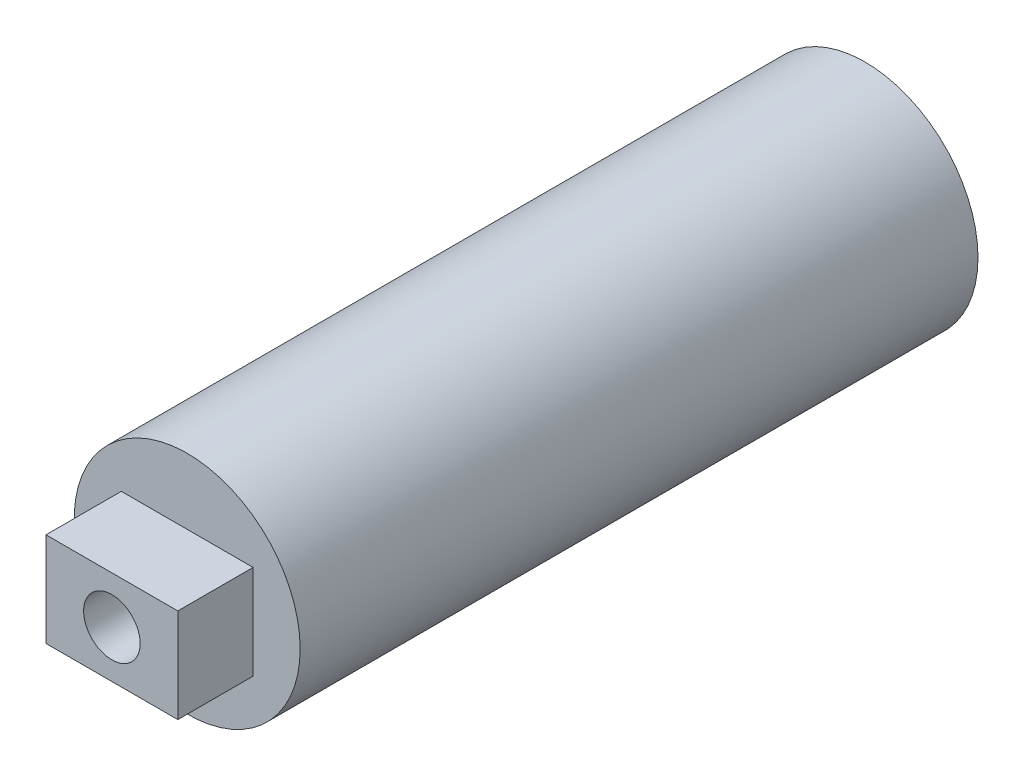
ISO-10303-21;
HEADER;
FILE_DESCRIPTION(('STEP AP214'),'2;1');
FILE_NAME('part.step','',(''),(''),'','','');
FILE_SCHEMA(('AUTOMOTIVE_DESIGN { 1 0 10303 214 1 1 1 1 }'));
ENDSEC;
DATA;
#1=APPLICATION_CONTEXT('core data for automotive mechanical design processes');
#2=APPLICATION_PROTOCOL_DEFINITION('international standard','automotive_design',2000,#1);
#3=PRODUCT_CONTEXT('',#1,'mechanical');
#4=PRODUCT('Part','Part','',(#3));
#5=PRODUCT_RELATED_PRODUCT_CATEGORY('part','',(#4));
#6=PRODUCT_DEFINITION_FORMATION('','',#4);
#7=PRODUCT_DEFINITION_CONTEXT('part definition',#1,'design');
#8=PRODUCT_DEFINITION('design','',#6,#7);
#9=PRODUCT_DEFINITION_SHAPE('','',#8);
#10=(LENGTH_UNIT() NAMED_UNIT(*) SI_UNIT(.MILLI.,.METRE.));
#11=(NAMED_UNIT(*) PLANE_ANGLE_UNIT() SI_UNIT($,.RADIAN.));
#12=(NAMED_UNIT(*) SI_UNIT($,.STERADIAN.) SOLID_ANGLE_UNIT());
#13=UNCERTAINTY_MEASURE_WITH_UNIT(LENGTH_MEASURE(1.E-05),#10,'distance_accuracy_value','');
#14=(GEOMETRIC_REPRESENTATION_CONTEXT(3) GLOBAL_UNCERTAINTY_ASSIGNED_CONTEXT((#13)) GLOBAL_UNIT_ASSIGNED_CONTEXT((#10,
#11,#12)) REPRESENTATION_CONTEXT('',''));
#15=CARTESIAN_POINT('',(0.,0.,0.));
#16=DIRECTION('',(0.,0.,1.));
#17=DIRECTION('',(1.,0.,0.));
#18=AXIS2_PLACEMENT_3D('',#15,#16,#17);
#19=CARTESIAN_POINT('',(0.,0.,0.));
#20=DIRECTION('',(0.,0.,1.));
#21=DIRECTION('',(1.,0.,0.));
#22=AXIS2_PLACEMENT_3D('',#19,#20,#21);
#23=PLANE('',#22);
#24=CARTESIAN_POINT('',(0.,0.,0.));
#25=DIRECTION('',(0.,0.,1.));
#26=DIRECTION('',(1.,0.,0.));
#27=AXIS2_PLACEMENT_3D('',#24,#25,#26);
#28=CIRCLE('',#27,7.5);
#29=CARTESIAN_POINT('',(7.5,0.,0.));
#30=VERTEX_POINT('',#29);
#31=EDGE_CURVE('E155',#30,#30,#28,.T.);
#32=ORIENTED_EDGE('',*,*,#31,.T.);
#33=EDGE_LOOP('',(#32));
#34=FACE_BOUND('',#33,.T.);
#35=CARTESIAN_POINT('',(0.,0.,0.));
#36=DIRECTION('',(0.,0.,1.));
#37=DIRECTION('',(1.,0.,0.));
#38=AXIS2_PLACEMENT_3D('',#35,#36,#37);
#39=CIRCLE('',#38,8.5);
#40=CARTESIAN_POINT('',(8.5,0.,0.));
#41=VERTEX_POINT('',#40);
#42=EDGE_CURVE('E149',#41,#41,#39,.T.);
#43=ORIENTED_EDGE('',*,*,#42,.F.);
#44=EDGE_LOOP('',(#43));
#45=FACE_BOUND('',#44,.T.);
#46=ADVANCED_FACE('F32',(#34,#45),#23,.F.);
#47=CARTESIAN_POINT('',(0.,0.,180.));
#48=DIRECTION('',(0.,0.,1.));
#49=DIRECTION('',(1.,0.,0.));
#50=AXIS2_PLACEMENT_3D('',#47,#48,#49);
#51=PLANE('',#50);
#52=CARTESIAN_POINT('',(0.,0.,180.));
#53=DIRECTION('',(0.,0.,1.));
#54=DIRECTION('',(1.,0.,0.));
#55=AXIS2_PLACEMENT_3D('',#52,#53,#54);
#56=CIRCLE('',#55,30.);
#57=CARTESIAN_POINT('',(30.,0.,180.));
#58=VERTEX_POINT('',#57);
#59=EDGE_CURVE('E11',#58,#58,#56,.T.);
#60=ORIENTED_EDGE('',*,*,#59,.T.);
#61=EDGE_LOOP('',(#60));
#62=FACE_BOUND('',#61,.T.);
#63=DIRECTION('',(-1.,0.,0.));
#64=VECTOR('',#63,1.);
#65=CARTESIAN_POINT('',(-17.5,12.5,180.));
#66=LINE('',#65,#64);
#67=CARTESIAN_POINT('',(17.5,12.5,180.));
#68=VERTEX_POINT('',#67);
#69=CARTESIAN_POINT('',(-17.5,12.5,180.));
#70=VERTEX_POINT('',#69);
#71=EDGE_CURVE('E171',#68,#70,#66,.T.);
#72=ORIENTED_EDGE('',*,*,#71,.F.);
#73=DIRECTION('',(0.,1.,0.));
#74=VECTOR('',#73,1.);
#75=CARTESIAN_POINT('',(17.5,12.5,180.));
#76=LINE('',#75,#74);
#77=CARTESIAN_POINT('',(17.5,-12.5,180.));
#78=VERTEX_POINT('',#77);
#79=EDGE_CURVE('E158',#78,#68,#76,.T.);
#80=ORIENTED_EDGE('',*,*,#79,.F.);
#81=DIRECTION('',(1.,0.,0.));
#82=VECTOR('',#81,1.);
#83=CARTESIAN_POINT('',(-17.5,-12.5,180.));
#84=LINE('',#83,#82);
#85=CARTESIAN_POINT('',(-17.5,-12.5,180.));
#86=VERTEX_POINT('',#85);
#87=EDGE_CURVE('E70',#86,#78,#84,.T.);
#88=ORIENTED_EDGE('',*,*,#87,.F.);
#89=DIRECTION('',(0.,-1.,0.));
#90=VECTOR('',#89,1.);
#91=CARTESIAN_POINT('',(-17.5,12.5,180.));
#92=LINE('',#91,#90);
#93=EDGE_CURVE('E173',#70,#86,#92,.T.);
#94=ORIENTED_EDGE('',*,*,#93,.F.);
#95=EDGE_LOOP('',(#72,#80,#88,#94));
#96=FACE_BOUND('',#95,.T.);
#97=ADVANCED_FACE('F198',(#62,#96),#51,.T.);
#98=CARTESIAN_POINT('',(0.,0.,180.));
#99=DIRECTION('',(0.,0.,-1.));
#100=DIRECTION('',(-1.,0.,0.));
#101=AXIS2_PLACEMENT_3D('',#98,#99,#100);
#102=CYLINDRICAL_SURFACE('',#101,30.);
#103=ORIENTED_EDGE('',*,*,#59,.F.);
#104=EDGE_LOOP('',(#103));
#105=FACE_BOUND('',#104,.T.);
#106=CARTESIAN_POINT('',(0.,0.,0.));
#107=DIRECTION('',(0.,0.,1.));
#108=DIRECTION('',(1.,0.,0.));
#109=AXIS2_PLACEMENT_3D('',#106,#107,#108);
#110=CIRCLE('',#109,30.);
#111=CARTESIAN_POINT('',(30.,0.,0.));
#112=VERTEX_POINT('',#111);
#113=EDGE_CURVE('E36',#112,#112,#110,.T.);
#114=ORIENTED_EDGE('',*,*,#113,.T.);
#115=EDGE_LOOP('',(#114));
#116=FACE_BOUND('',#115,.T.);
#117=ADVANCED_FACE('F34',(#105,#116),#102,.T.);
#118=CARTESIAN_POINT('',(0.,0.,0.));
#119=DIRECTION('',(0.,0.,1.));
#120=DIRECTION('',(1.,0.,0.));
#121=AXIS2_PLACEMENT_3D('',#118,#119,#120);
#122=CIRCLE('',#121,29.);
#123=CARTESIAN_POINT('',(29.,0.,0.));
#124=VERTEX_POINT('',#123);
#125=EDGE_CURVE('E134',#124,#124,#122,.T.);
#126=ORIENTED_EDGE('',*,*,#125,.T.);
#127=EDGE_LOOP('',(#126));
#128=FACE_BOUND('',#127,.T.);
#129=ORIENTED_EDGE('',*,*,#113,.F.);
#130=EDGE_LOOP('',(#129));
#131=FACE_BOUND('',#130,.T.);
#132=ADVANCED_FACE('F187',(#128,#131),#23,.F.);
#133=CARTESIAN_POINT('',(17.5,12.5,200.));
#134=DIRECTION('',(-1.,0.,0.));
#135=DIRECTION('',(0.,0.,1.));
#136=AXIS2_PLACEMENT_3D('',#133,#134,#135);
#137=PLANE('',#136);
#138=ORIENTED_EDGE('',*,*,#79,.T.);
#139=DIRECTION('',(0.,0.,-1.));
#140=VECTOR('',#139,1.);
#141=CARTESIAN_POINT('',(17.5,12.5,200.));
#142=LINE('',#141,#140);
#143=CARTESIAN_POINT('',(17.5,12.5,200.));
#144=VERTEX_POINT('',#143);
#145=EDGE_CURVE('E181',#144,#68,#142,.T.);
#146=ORIENTED_EDGE('',*,*,#145,.F.);
#147=DIRECTION('',(0.,1.,0.));
#148=VECTOR('',#147,1.);
#149=CARTESIAN_POINT('',(17.5,12.5,200.));
#150=LINE('',#149,#148);
#151=CARTESIAN_POINT('',(17.5,-12.5,200.));
#152=VERTEX_POINT('',#151);
#153=EDGE_CURVE('E162',#152,#144,#150,.T.);
#154=ORIENTED_EDGE('',*,*,#153,.F.);
#155=DIRECTION('',(0.,0.,-1.));
#156=VECTOR('',#155,1.);
#157=CARTESIAN_POINT('',(17.5,-12.5,200.));
#158=LINE('',#157,#156);
#159=EDGE_CURVE('E168',#152,#78,#158,.T.);
#160=ORIENTED_EDGE('',*,*,#159,.T.);
#161=EDGE_LOOP('',(#138,#146,#154,#160));
#162=FACE_BOUND('',#161,.T.);
#163=ADVANCED_FACE('F189',(#162),#137,.F.);
#164=CARTESIAN_POINT('',(-17.5,12.5,200.));
#165=DIRECTION('',(0.,-1.,0.));
#166=DIRECTION('',(0.,0.,-1.));
#167=AXIS2_PLACEMENT_3D('',#164,#165,#166);
#168=PLANE('',#167);
#169=ORIENTED_EDGE('',*,*,#71,.T.);
#170=DIRECTION('',(0.,0.,-1.));
#171=VECTOR('',#170,1.);
#172=CARTESIAN_POINT('',(-17.5,12.5,200.));
#173=LINE('',#172,#171);
#174=CARTESIAN_POINT('',(-17.5,12.5,200.));
#175=VERTEX_POINT('',#174);
#176=EDGE_CURVE('E178',#175,#70,#173,.T.);
#177=ORIENTED_EDGE('',*,*,#176,.F.);
#178=DIRECTION('',(-1.,0.,0.));
#179=VECTOR('',#178,1.);
#180=CARTESIAN_POINT('',(-17.5,12.5,200.));
#181=LINE('',#180,#179);
#182=EDGE_CURVE('E77',#144,#175,#181,.T.);
#183=ORIENTED_EDGE('',*,*,#182,.F.);
#184=ORIENTED_EDGE('',*,*,#145,.T.);
#185=EDGE_LOOP('',(#169,#177,#183,#184));
#186=FACE_BOUND('',#185,.T.);
#187=ADVANCED_FACE('F195',(#186),#168,.F.);
#188=CARTESIAN_POINT('',(-17.5,12.5,200.));
#189=DIRECTION('',(1.,0.,0.));
#190=DIRECTION('',(0.,1.,0.));
#191=AXIS2_PLACEMENT_3D('',#188,#189,#190);
#192=PLANE('',#191);
#193=ORIENTED_EDGE('',*,*,#93,.T.);
#194=DIRECTION('',(0.,0.,-1.));
#195=VECTOR('',#194,1.);
#196=CARTESIAN_POINT('',(-17.5,-12.5,200.));
#197=LINE('',#196,#195);
#198=CARTESIAN_POINT('',(-17.5,-12.5,200.));
#199=VERTEX_POINT('',#198);
#200=EDGE_CURVE('E47',#199,#86,#197,.T.);
#201=ORIENTED_EDGE('',*,*,#200,.F.);
#202=DIRECTION('',(0.,-1.,0.));
#203=VECTOR('',#202,1.);
#204=CARTESIAN_POINT('',(-17.5,12.5,200.));
#205=LINE('',#204,#203);
#206=EDGE_CURVE('E165',#175,#199,#205,.T.);
#207=ORIENTED_EDGE('',*,*,#206,.F.);
#208=ORIENTED_EDGE('',*,*,#176,.T.);
#209=EDGE_LOOP('',(#193,#201,#207,#208));
#210=FACE_BOUND('',#209,.T.);
#211=ADVANCED_FACE('F247',(#210),#192,.F.);
#212=CARTESIAN_POINT('',(-17.5,-12.5,200.));
#213=DIRECTION('',(0.,1.,0.));
#214=DIRECTION('',(0.,0.,1.));
#215=AXIS2_PLACEMENT_3D('',#212,#213,#214);
#216=PLANE('',#215);
#217=ORIENTED_EDGE('',*,*,#87,.T.);
#218=ORIENTED_EDGE('',*,*,#159,.F.);
#219=DIRECTION('',(1.,0.,0.));
#220=VECTOR('',#219,1.);
#221=CARTESIAN_POINT('',(-17.5,-12.5,200.));
#222=LINE('',#221,#220);
#223=EDGE_CURVE('E55',#199,#152,#222,.T.);
#224=ORIENTED_EDGE('',*,*,#223,.F.);
#225=ORIENTED_EDGE('',*,*,#200,.T.);
#226=EDGE_LOOP('',(#217,#218,#224,#225));
#227=FACE_BOUND('',#226,.T.);
#228=ADVANCED_FACE('F243',(#227),#216,.F.);
#229=CARTESIAN_POINT('',(0.,0.,200.));
#230=DIRECTION('',(0.,0.,1.));
#231=DIRECTION('',(1.,0.,0.));
#232=AXIS2_PLACEMENT_3D('',#229,#230,#231);
#233=PLANE('',#232);
#234=CARTESIAN_POINT('',(0.,0.,200.));
#235=DIRECTION('',(0.,0.,1.));
#236=DIRECTION('',(1.,0.,0.));
#237=AXIS2_PLACEMENT_3D('',#234,#235,#236);
#238=CIRCLE('',#237,7.5);
#239=CARTESIAN_POINT('',(7.5,0.,200.));
#240=VERTEX_POINT('',#239);
#241=EDGE_CURVE('E159',#240,#240,#238,.T.);
#242=ORIENTED_EDGE('',*,*,#241,.F.);
#243=EDGE_LOOP('',(#242));
#244=FACE_BOUND('',#243,.T.);
#245=ORIENTED_EDGE('',*,*,#153,.T.);
#246=ORIENTED_EDGE('',*,*,#182,.T.);
#247=ORIENTED_EDGE('',*,*,#206,.T.);
#248=ORIENTED_EDGE('',*,*,#223,.T.);
#249=EDGE_LOOP('',(#245,#246,#247,#248));
#250=FACE_BOUND('',#249,.T.);
#251=ADVANCED_FACE('F239',(#244,#250),#233,.T.);
#252=CARTESIAN_POINT('',(0.,0.,0.));
#253=DIRECTION('',(0.,0.,1.));
#254=DIRECTION('',(1.,0.,0.));
#255=AXIS2_PLACEMENT_3D('',#252,#253,#254);
#256=CYLINDRICAL_SURFACE('',#255,7.5);
#257=ORIENTED_EDGE('',*,*,#31,.F.);
#258=EDGE_LOOP('',(#257));
#259=FACE_BOUND('',#258,.T.);
#260=ORIENTED_EDGE('',*,*,#241,.T.);
#261=EDGE_LOOP('',(#260));
#262=FACE_BOUND('',#261,.T.);
#263=ADVANCED_FACE('F236',(#259,#262),#256,.F.);
#264=CARTESIAN_POINT('',(0.,0.,179.));
#265=DIRECTION('',(0.,0.,1.));
#266=DIRECTION('',(1.,0.,0.));
#267=AXIS2_PLACEMENT_3D('',#264,#265,#266);
#268=PLANE('',#267);
#269=CARTESIAN_POINT('',(0.,0.,179.));
#270=DIRECTION('',(0.,0.,1.));
#271=DIRECTION('',(1.,0.,0.));
#272=AXIS2_PLACEMENT_3D('',#269,#270,#271);
#273=CIRCLE('',#272,29.);
#274=CARTESIAN_POINT('',(29.,0.,179.));
#275=VERTEX_POINT('',#274);
#276=EDGE_CURVE('E152',#275,#275,#273,.T.);
#277=ORIENTED_EDGE('',*,*,#276,.F.);
#278=EDGE_LOOP('',(#277));
#279=FACE_BOUND('',#278,.T.);
#280=DIRECTION('',(-1.,0.,0.));
#281=VECTOR('',#280,1.);
#282=CARTESIAN_POINT('',(-17.5,11.5,179.));
#283=LINE('',#282,#281);
#284=CARTESIAN_POINT('',(16.5,11.5,179.));
#285=VERTEX_POINT('',#284);
#286=CARTESIAN_POINT('',(-16.5,11.5,179.));
#287=VERTEX_POINT('',#286);
#288=EDGE_CURVE('E105',#285,#287,#283,.T.);
#289=ORIENTED_EDGE('',*,*,#288,.T.);
#290=DIRECTION('',(0.,-1.,0.));
#291=VECTOR('',#290,1.);
#292=CARTESIAN_POINT('',(-16.5,12.5,179.));
#293=LINE('',#292,#291);
#294=CARTESIAN_POINT('',(-16.5,-11.5,179.));
#295=VERTEX_POINT('',#294);
#296=EDGE_CURVE('E109',#287,#295,#293,.T.);
#297=ORIENTED_EDGE('',*,*,#296,.T.);
#298=DIRECTION('',(1.,0.,0.));
#299=VECTOR('',#298,1.);
#300=CARTESIAN_POINT('',(-17.5,-11.5,179.));
#301=LINE('',#300,#299);
#302=CARTESIAN_POINT('',(16.5,-11.5,179.));
#303=VERTEX_POINT('',#302);
#304=EDGE_CURVE('E127',#295,#303,#301,.T.);
#305=ORIENTED_EDGE('',*,*,#304,.T.);
#306=DIRECTION('',(0.,1.,0.));
#307=VECTOR('',#306,1.);
#308=CARTESIAN_POINT('',(16.5,12.5,179.));
#309=LINE('',#308,#307);
#310=EDGE_CURVE('E112',#303,#285,#309,.T.);
#311=ORIENTED_EDGE('',*,*,#310,.T.);
#312=EDGE_LOOP('',(#289,#297,#305,#311));
#313=FACE_BOUND('',#312,.T.);
#314=ADVANCED_FACE('F107',(#279,#313),#268,.F.);
#315=CARTESIAN_POINT('',(0.,0.,180.));
#316=DIRECTION('',(0.,0.,-1.));
#317=DIRECTION('',(-1.,0.,0.));
#318=AXIS2_PLACEMENT_3D('',#315,#316,#317);
#319=CYLINDRICAL_SURFACE('',#318,29.);
#320=ORIENTED_EDGE('',*,*,#276,.T.);
#321=EDGE_LOOP('',(#320));
#322=FACE_BOUND('',#321,.T.);
#323=ORIENTED_EDGE('',*,*,#125,.F.);
#324=EDGE_LOOP('',(#323));
#325=FACE_BOUND('',#324,.T.);
#326=ADVANCED_FACE('F284',(#322,#325),#319,.F.);
#327=CARTESIAN_POINT('',(16.5,12.5,200.));
#328=DIRECTION('',(-1.,0.,0.));
#329=DIRECTION('',(0.,0.,1.));
#330=AXIS2_PLACEMENT_3D('',#327,#328,#329);
#331=PLANE('',#330);
#332=ORIENTED_EDGE('',*,*,#310,.F.);
#333=DIRECTION('',(0.,0.,-1.));
#334=VECTOR('',#333,1.);
#335=CARTESIAN_POINT('',(16.5,-11.5,200.));
#336=LINE('',#335,#334);
#337=CARTESIAN_POINT('',(16.5,-11.5,199.));
#338=VERTEX_POINT('',#337);
#339=EDGE_CURVE('E137',#338,#303,#336,.T.);
#340=ORIENTED_EDGE('',*,*,#339,.F.);
#341=DIRECTION('',(0.,1.,0.));
#342=VECTOR('',#341,1.);
#343=CARTESIAN_POINT('',(16.5,12.5,199.));
#344=LINE('',#343,#342);
#345=CARTESIAN_POINT('',(16.5,11.5,199.));
#346=VERTEX_POINT('',#345);
#347=EDGE_CURVE('E129',#338,#346,#344,.T.);
#348=ORIENTED_EDGE('',*,*,#347,.T.);
#349=DIRECTION('',(0.,0.,-1.));
#350=VECTOR('',#349,1.);
#351=CARTESIAN_POINT('',(16.5,11.5,200.));
#352=LINE('',#351,#350);
#353=EDGE_CURVE('E122',#346,#285,#352,.T.);
#354=ORIENTED_EDGE('',*,*,#353,.T.);
#355=EDGE_LOOP('',(#332,#340,#348,#354));
#356=FACE_BOUND('',#355,.T.);
#357=ADVANCED_FACE('F226',(#356),#331,.T.);
#358=CARTESIAN_POINT('',(-17.5,11.5,200.));
#359=DIRECTION('',(0.,-1.,0.));
#360=DIRECTION('',(0.,0.,-1.));
#361=AXIS2_PLACEMENT_3D('',#358,#359,#360);
#362=PLANE('',#361);
#363=ORIENTED_EDGE('',*,*,#288,.F.);
#364=ORIENTED_EDGE('',*,*,#353,.F.);
#365=DIRECTION('',(-1.,0.,0.));
#366=VECTOR('',#365,1.);
#367=CARTESIAN_POINT('',(-17.5,11.5,199.));
#368=LINE('',#367,#366);
#369=CARTESIAN_POINT('',(-16.5,11.5,199.));
#370=VERTEX_POINT('',#369);
#371=EDGE_CURVE('E119',#346,#370,#368,.T.);
#372=ORIENTED_EDGE('',*,*,#371,.T.);
#373=DIRECTION('',(0.,0.,-1.));
#374=VECTOR('',#373,1.);
#375=CARTESIAN_POINT('',(-16.5,11.5,200.));
#376=LINE('',#375,#374);
#377=EDGE_CURVE('E117',#370,#287,#376,.T.);
#378=ORIENTED_EDGE('',*,*,#377,.T.);
#379=EDGE_LOOP('',(#363,#364,#372,#378));
#380=FACE_BOUND('',#379,.T.);
#381=ADVANCED_FACE('F118',(#380),#362,.T.);
#382=CARTESIAN_POINT('',(-16.5,12.5,200.));
#383=DIRECTION('',(1.,0.,0.));
#384=DIRECTION('',(0.,1.,0.));
#385=AXIS2_PLACEMENT_3D('',#382,#383,#384);
#386=PLANE('',#385);
#387=ORIENTED_EDGE('',*,*,#296,.F.);
#388=ORIENTED_EDGE('',*,*,#377,.F.);
#389=DIRECTION('',(0.,-1.,0.));
#390=VECTOR('',#389,1.);
#391=CARTESIAN_POINT('',(-16.5,12.5,199.));
#392=LINE('',#391,#390);
#393=CARTESIAN_POINT('',(-16.5,-11.5,199.));
#394=VERTEX_POINT('',#393);
#395=EDGE_CURVE('E142',#370,#394,#392,.T.);
#396=ORIENTED_EDGE('',*,*,#395,.T.);
#397=DIRECTION('',(0.,0.,-1.));
#398=VECTOR('',#397,1.);
#399=CARTESIAN_POINT('',(-16.5,-11.5,200.));
#400=LINE('',#399,#398);
#401=EDGE_CURVE('E123',#394,#295,#400,.T.);
#402=ORIENTED_EDGE('',*,*,#401,.T.);
#403=EDGE_LOOP('',(#387,#388,#396,#402));
#404=FACE_BOUND('',#403,.T.);
#405=ADVANCED_FACE('F125',(#404),#386,.T.);
#406=CARTESIAN_POINT('',(-17.5,-11.5,200.));
#407=DIRECTION('',(0.,1.,0.));
#408=DIRECTION('',(0.,0.,1.));
#409=AXIS2_PLACEMENT_3D('',#406,#407,#408);
#410=PLANE('',#409);
#411=ORIENTED_EDGE('',*,*,#304,.F.);
#412=ORIENTED_EDGE('',*,*,#401,.F.);
#413=DIRECTION('',(1.,0.,0.));
#414=VECTOR('',#413,1.);
#415=CARTESIAN_POINT('',(-17.5,-11.5,199.));
#416=LINE('',#415,#414);
#417=EDGE_CURVE('E139',#394,#338,#416,.T.);
#418=ORIENTED_EDGE('',*,*,#417,.T.);
#419=ORIENTED_EDGE('',*,*,#339,.T.);
#420=EDGE_LOOP('',(#411,#412,#418,#419));
#421=FACE_BOUND('',#420,.T.);
#422=ADVANCED_FACE('F220',(#421),#410,.T.);
#423=CARTESIAN_POINT('',(0.,0.,199.));
#424=DIRECTION('',(0.,0.,1.));
#425=DIRECTION('',(1.,0.,0.));
#426=AXIS2_PLACEMENT_3D('',#423,#424,#425);
#427=PLANE('',#426);
#428=CARTESIAN_POINT('',(0.,0.,199.));
#429=DIRECTION('',(0.,0.,1.));
#430=DIRECTION('',(1.,0.,0.));
#431=AXIS2_PLACEMENT_3D('',#428,#429,#430);
#432=CIRCLE('',#431,8.5);
#433=CARTESIAN_POINT('',(8.5,0.,199.));
#434=VERTEX_POINT('',#433);
#435=EDGE_CURVE('E146',#434,#434,#432,.T.);
#436=ORIENTED_EDGE('',*,*,#435,.T.);
#437=EDGE_LOOP('',(#436));
#438=FACE_BOUND('',#437,.T.);
#439=ORIENTED_EDGE('',*,*,#347,.F.);
#440=ORIENTED_EDGE('',*,*,#417,.F.);
#441=ORIENTED_EDGE('',*,*,#395,.F.);
#442=ORIENTED_EDGE('',*,*,#371,.F.);
#443=EDGE_LOOP('',(#439,#440,#441,#442));
#444=FACE_BOUND('',#443,.T.);
#445=ADVANCED_FACE('F214',(#438,#444),#427,.F.);
#446=CARTESIAN_POINT('',(0.,0.,0.));
#447=DIRECTION('',(0.,0.,1.));
#448=DIRECTION('',(1.,0.,0.));
#449=AXIS2_PLACEMENT_3D('',#446,#447,#448);
#450=CYLINDRICAL_SURFACE('',#449,8.5);
#451=ORIENTED_EDGE('',*,*,#42,.T.);
#452=EDGE_LOOP('',(#451));
#453=FACE_BOUND('',#452,.T.);
#454=ORIENTED_EDGE('',*,*,#435,.F.);
#455=EDGE_LOOP('',(#454));
#456=FACE_BOUND('',#455,.T.);
#457=ADVANCED_FACE('F211',(#453,#456),#450,.T.);
#458=CLOSED_SHELL('',(#46,#97,#117,#132,#163,#187,#211,#228,#251,#263,#314,#326,#357,#381,#405,
#422,#445,#457));
#459=MANIFOLD_SOLID_BREP('B2',#458);
#460=ADVANCED_BREP_SHAPE_REPRESENTATION('',(#18,#459),#14);
#461=SHAPE_DEFINITION_REPRESENTATION(#9,#460);
ENDSEC;
END-ISO-10303-21;
